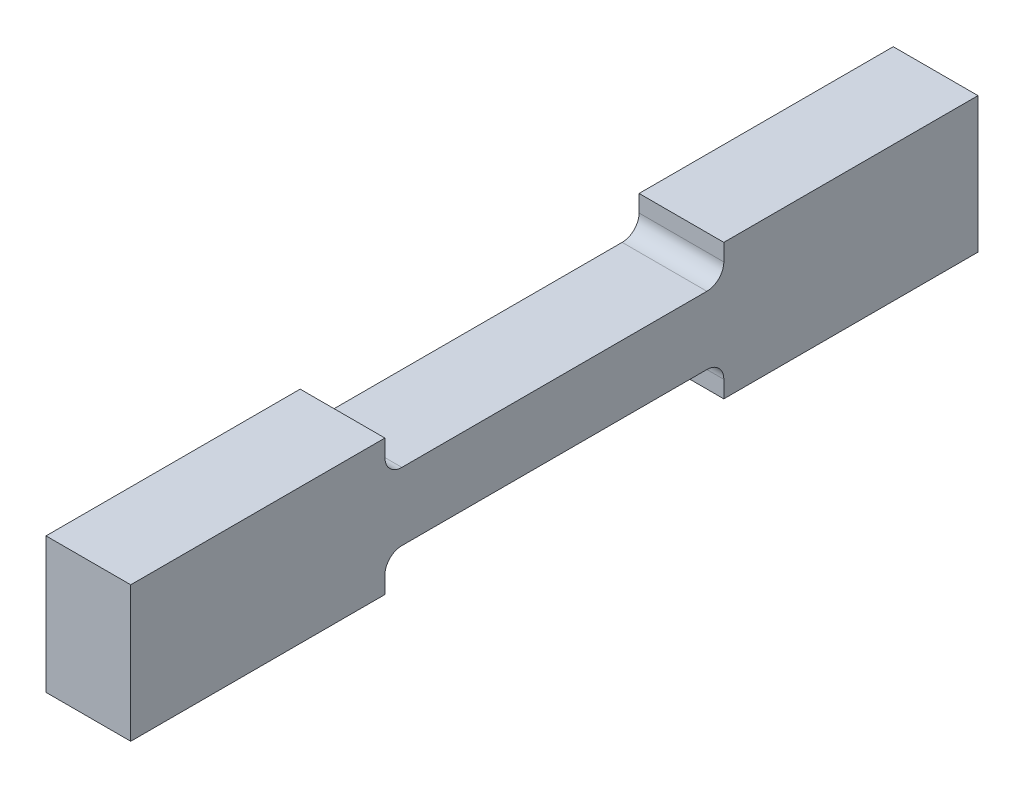
ISO-10303-21;
HEADER;
FILE_DESCRIPTION(('STEP AP214'),'2;1');
FILE_NAME('part.step','',(''),(''),'','','');
FILE_SCHEMA(('AUTOMOTIVE_DESIGN { 1 0 10303 214 1 1 1 1 }'));
ENDSEC;
DATA;
#1=APPLICATION_CONTEXT('core data for automotive mechanical design processes');
#2=APPLICATION_PROTOCOL_DEFINITION('international standard','automotive_design',2000,#1);
#3=PRODUCT_CONTEXT('',#1,'mechanical');
#4=PRODUCT('Part','Part','',(#3));
#5=PRODUCT_RELATED_PRODUCT_CATEGORY('part','',(#4));
#6=PRODUCT_DEFINITION_FORMATION('','',#4);
#7=PRODUCT_DEFINITION_CONTEXT('part definition',#1,'design');
#8=PRODUCT_DEFINITION('design','',#6,#7);
#9=PRODUCT_DEFINITION_SHAPE('','',#8);
#10=(LENGTH_UNIT() NAMED_UNIT(*) SI_UNIT(.MILLI.,.METRE.));
#11=(NAMED_UNIT(*) PLANE_ANGLE_UNIT() SI_UNIT($,.RADIAN.));
#12=(NAMED_UNIT(*) SI_UNIT($,.STERADIAN.) SOLID_ANGLE_UNIT());
#13=UNCERTAINTY_MEASURE_WITH_UNIT(LENGTH_MEASURE(1.E-05),#10,'distance_accuracy_value','');
#14=(GEOMETRIC_REPRESENTATION_CONTEXT(3) GLOBAL_UNCERTAINTY_ASSIGNED_CONTEXT((#13)) GLOBAL_UNIT_ASSIGNED_CONTEXT((#10,
#11,#12)) REPRESENTATION_CONTEXT('',''));
#15=CARTESIAN_POINT('',(0.,0.,0.));
#16=DIRECTION('',(0.,0.,1.));
#17=DIRECTION('',(1.,0.,0.));
#18=AXIS2_PLACEMENT_3D('',#15,#16,#17);
#19=CARTESIAN_POINT('',(2.5,-1.5,4.49999999999995));
#20=DIRECTION('',(-1.,0.,0.));
#21=DIRECTION('',(0.,0.,1.));
#22=AXIS2_PLACEMENT_3D('',#19,#20,#21);
#23=CYLINDRICAL_SURFACE('',#22,0.5);
#24=DIRECTION('',(-1.,0.,0.));
#25=VECTOR('',#24,1.);
#26=CARTESIAN_POINT('',(2.5,-1.,4.5));
#27=LINE('',#26,#25);
#28=CARTESIAN_POINT('',(2.5,-1.,4.5));
#29=VERTEX_POINT('',#28);
#30=CARTESIAN_POINT('',(0.,-1.,4.5));
#31=VERTEX_POINT('',#30);
#32=EDGE_CURVE('E276',#29,#31,#27,.T.);
#33=ORIENTED_EDGE('',*,*,#32,.F.);
#34=CARTESIAN_POINT('',(2.5,-1.5,4.49999999999995));
#35=DIRECTION('',(-1.,0.,0.));
#36=DIRECTION('',(0.,0.,1.));
#37=AXIS2_PLACEMENT_3D('',#34,#35,#36);
#38=CIRCLE('',#37,0.5);
#39=CARTESIAN_POINT('',(2.5,-1.49999999999995,5.));
#40=VERTEX_POINT('',#39);
#41=EDGE_CURVE('E53',#29,#40,#38,.F.);
#42=ORIENTED_EDGE('',*,*,#41,.T.);
#43=DIRECTION('',(-1.,0.,0.));
#44=VECTOR('',#43,1.);
#45=CARTESIAN_POINT('',(2.5,-1.49999999999995,5.));
#46=LINE('',#45,#44);
#47=CARTESIAN_POINT('',(0.,-1.49999999999995,5.));
#48=VERTEX_POINT('',#47);
#49=EDGE_CURVE('E279',#48,#40,#46,.F.);
#50=ORIENTED_EDGE('',*,*,#49,.F.);
#51=CARTESIAN_POINT('',(0.,-1.5,4.49999999999995));
#52=DIRECTION('',(-1.,0.,0.));
#53=DIRECTION('',(0.,0.,1.));
#54=AXIS2_PLACEMENT_3D('',#51,#52,#53);
#55=CIRCLE('',#54,0.5);
#56=EDGE_CURVE('E13',#48,#31,#55,.T.);
#57=ORIENTED_EDGE('',*,*,#56,.T.);
#58=EDGE_LOOP('',(#33,#42,#50,#57));
#59=FACE_BOUND('',#58,.T.);
#60=ADVANCED_FACE('F46',(#59),#23,.F.);
#61=CARTESIAN_POINT('',(2.5,1.5,4.49999999999995));
#62=DIRECTION('',(1.,0.,0.));
#63=DIRECTION('',(0.,0.,-1.));
#64=AXIS2_PLACEMENT_3D('',#61,#62,#63);
#65=CYLINDRICAL_SURFACE('',#64,0.5);
#66=DIRECTION('',(1.,0.,0.));
#67=VECTOR('',#66,1.);
#68=CARTESIAN_POINT('',(2.5,1.,4.5));
#69=LINE('',#68,#67);
#70=CARTESIAN_POINT('',(0.,1.,4.5));
#71=VERTEX_POINT('',#70);
#72=CARTESIAN_POINT('',(2.5,1.,4.5));
#73=VERTEX_POINT('',#72);
#74=EDGE_CURVE('E266',#71,#73,#69,.T.);
#75=ORIENTED_EDGE('',*,*,#74,.F.);
#76=CARTESIAN_POINT('',(0.,1.5,4.49999999999995));
#77=DIRECTION('',(-1.,0.,0.));
#78=DIRECTION('',(0.,0.,1.));
#79=AXIS2_PLACEMENT_3D('',#76,#77,#78);
#80=CIRCLE('',#79,0.5);
#81=CARTESIAN_POINT('',(0.,1.50000000000006,4.99999999999989));
#82=VERTEX_POINT('',#81);
#83=EDGE_CURVE('E272',#71,#82,#80,.T.);
#84=ORIENTED_EDGE('',*,*,#83,.T.);
#85=DIRECTION('',(1.,0.,0.));
#86=VECTOR('',#85,1.);
#87=CARTESIAN_POINT('',(2.5,1.50000000000006,4.99999999999989));
#88=LINE('',#87,#86);
#89=CARTESIAN_POINT('',(2.5,1.50000000000006,4.99999999999989));
#90=VERTEX_POINT('',#89);
#91=EDGE_CURVE('E269',#90,#82,#88,.F.);
#92=ORIENTED_EDGE('',*,*,#91,.F.);
#93=CARTESIAN_POINT('',(2.5,1.5,4.49999999999995));
#94=DIRECTION('',(-1.,0.,0.));
#95=DIRECTION('',(0.,0.,1.));
#96=AXIS2_PLACEMENT_3D('',#93,#94,#95);
#97=CIRCLE('',#96,0.5);
#98=EDGE_CURVE('E274',#90,#73,#97,.F.);
#99=ORIENTED_EDGE('',*,*,#98,.T.);
#100=EDGE_LOOP('',(#75,#84,#92,#99));
#101=FACE_BOUND('',#100,.T.);
#102=ADVANCED_FACE('F327',(#101),#65,.F.);
#103=CARTESIAN_POINT('',(2.5,-1.5,-4.50000000000012));
#104=DIRECTION('',(1.,0.,0.));
#105=DIRECTION('',(0.,0.,-1.));
#106=AXIS2_PLACEMENT_3D('',#103,#104,#105);
#107=CYLINDRICAL_SURFACE('',#106,0.5);
#108=DIRECTION('',(-1.,0.,0.));
#109=VECTOR('',#108,1.);
#110=CARTESIAN_POINT('',(2.5,-1.50000000000006,-5.));
#111=LINE('',#110,#109);
#112=CARTESIAN_POINT('',(2.5,-1.50000000000006,-5.));
#113=VERTEX_POINT('',#112);
#114=CARTESIAN_POINT('',(0.,-1.50000000000006,-5.));
#115=VERTEX_POINT('',#114);
#116=EDGE_CURVE('E255',#113,#115,#111,.T.);
#117=ORIENTED_EDGE('',*,*,#116,.F.);
#118=CARTESIAN_POINT('',(2.5,-1.5,-4.50000000000012));
#119=DIRECTION('',(-1.,0.,0.));
#120=DIRECTION('',(0.,0.,1.));
#121=AXIS2_PLACEMENT_3D('',#118,#119,#120);
#122=CIRCLE('',#121,0.5);
#123=CARTESIAN_POINT('',(2.5,-1.,-4.5));
#124=VERTEX_POINT('',#123);
#125=EDGE_CURVE('E261',#113,#124,#122,.F.);
#126=ORIENTED_EDGE('',*,*,#125,.T.);
#127=DIRECTION('',(-1.,0.,0.));
#128=VECTOR('',#127,1.);
#129=CARTESIAN_POINT('',(2.5,-1.,-4.5));
#130=LINE('',#129,#128);
#131=CARTESIAN_POINT('',(0.,-1.,-4.5));
#132=VERTEX_POINT('',#131);
#133=EDGE_CURVE('E258',#132,#124,#130,.F.);
#134=ORIENTED_EDGE('',*,*,#133,.F.);
#135=CARTESIAN_POINT('',(0.,-1.5,-4.50000000000012));
#136=DIRECTION('',(-1.,0.,0.));
#137=DIRECTION('',(0.,0.,1.));
#138=AXIS2_PLACEMENT_3D('',#135,#136,#137);
#139=CIRCLE('',#138,0.5);
#140=EDGE_CURVE('E264',#132,#115,#139,.T.);
#141=ORIENTED_EDGE('',*,*,#140,.T.);
#142=EDGE_LOOP('',(#117,#126,#134,#141));
#143=FACE_BOUND('',#142,.T.);
#144=ADVANCED_FACE('F290',(#143),#107,.F.);
#145=CARTESIAN_POINT('',(2.5,1.5,-4.5));
#146=DIRECTION('',(-1.,0.,0.));
#147=DIRECTION('',(0.,0.,1.));
#148=AXIS2_PLACEMENT_3D('',#145,#146,#147);
#149=CYLINDRICAL_SURFACE('',#148,0.5);
#150=DIRECTION('',(1.,0.,0.));
#151=VECTOR('',#150,1.);
#152=CARTESIAN_POINT('',(2.5,1.5,-5.));
#153=LINE('',#152,#151);
#154=CARTESIAN_POINT('',(0.,1.5,-5.));
#155=VERTEX_POINT('',#154);
#156=CARTESIAN_POINT('',(2.5,1.5,-5.));
#157=VERTEX_POINT('',#156);
#158=EDGE_CURVE('E229',#155,#157,#153,.T.);
#159=ORIENTED_EDGE('',*,*,#158,.F.);
#160=CARTESIAN_POINT('',(0.,1.5,-4.5));
#161=DIRECTION('',(-1.,0.,0.));
#162=DIRECTION('',(0.,0.,1.));
#163=AXIS2_PLACEMENT_3D('',#160,#161,#162);
#164=CIRCLE('',#163,0.5);
#165=CARTESIAN_POINT('',(0.,1.,-4.5));
#166=VERTEX_POINT('',#165);
#167=EDGE_CURVE('E250',#155,#166,#164,.T.);
#168=ORIENTED_EDGE('',*,*,#167,.T.);
#169=DIRECTION('',(1.,0.,0.));
#170=VECTOR('',#169,1.);
#171=CARTESIAN_POINT('',(2.5,1.,-4.5));
#172=LINE('',#171,#170);
#173=CARTESIAN_POINT('',(2.5,1.,-4.5));
#174=VERTEX_POINT('',#173);
#175=EDGE_CURVE('E247',#174,#166,#172,.F.);
#176=ORIENTED_EDGE('',*,*,#175,.F.);
#177=CARTESIAN_POINT('',(2.5,1.5,-4.5));
#178=DIRECTION('',(-1.,0.,0.));
#179=DIRECTION('',(0.,0.,1.));
#180=AXIS2_PLACEMENT_3D('',#177,#178,#179);
#181=CIRCLE('',#180,0.5);
#182=EDGE_CURVE('E253',#174,#157,#181,.F.);
#183=ORIENTED_EDGE('',*,*,#182,.T.);
#184=EDGE_LOOP('',(#159,#168,#176,#183));
#185=FACE_BOUND('',#184,.T.);
#186=ADVANCED_FACE('F318',(#185),#149,.F.);
#187=CARTESIAN_POINT('',(2.5,-2.,5.00000000000006));
#188=DIRECTION('',(0.,-1.,0.));
#189=DIRECTION('',(0.,0.,-1.));
#190=AXIS2_PLACEMENT_3D('',#187,#188,#189);
#191=PLANE('',#190);
#192=DIRECTION('',(0.,0.,1.));
#193=VECTOR('',#192,1.);
#194=CARTESIAN_POINT('',(0.,-2.,5.00000000000006));
#195=LINE('',#194,#193);
#196=CARTESIAN_POINT('',(0.,-2.,5.00000000000006));
#197=VERTEX_POINT('',#196);
#198=CARTESIAN_POINT('',(0.,-2.,12.5));
#199=VERTEX_POINT('',#198);
#200=EDGE_CURVE('E205',#197,#199,#195,.T.);
#201=ORIENTED_EDGE('',*,*,#200,.F.);
#202=DIRECTION('',(-1.,0.,0.));
#203=VECTOR('',#202,1.);
#204=CARTESIAN_POINT('',(2.5,-2.,5.00000000000006));
#205=LINE('',#204,#203);
#206=CARTESIAN_POINT('',(2.5,-2.,5.00000000000006));
#207=VERTEX_POINT('',#206);
#208=EDGE_CURVE('E180',#207,#197,#205,.T.);
#209=ORIENTED_EDGE('',*,*,#208,.F.);
#210=DIRECTION('',(0.,0.,1.));
#211=VECTOR('',#210,1.);
#212=CARTESIAN_POINT('',(2.5,-2.,5.00000000000006));
#213=LINE('',#212,#211);
#214=CARTESIAN_POINT('',(2.5,-2.,12.5));
#215=VERTEX_POINT('',#214);
#216=EDGE_CURVE('E172',#207,#215,#213,.T.);
#217=ORIENTED_EDGE('',*,*,#216,.T.);
#218=DIRECTION('',(-1.,0.,0.));
#219=VECTOR('',#218,1.);
#220=CARTESIAN_POINT('',(2.5,-2.,12.5));
#221=LINE('',#220,#219);
#222=EDGE_CURVE('E155',#215,#199,#221,.T.);
#223=ORIENTED_EDGE('',*,*,#222,.T.);
#224=EDGE_LOOP('',(#201,#209,#217,#223));
#225=FACE_BOUND('',#224,.T.);
#226=ADVANCED_FACE('F178',(#225),#191,.T.);
#227=CARTESIAN_POINT('',(2.5,-1.,4.99999999999989));
#228=DIRECTION('',(0.,0.,-1.));
#229=DIRECTION('',(-1.,0.,0.));
#230=AXIS2_PLACEMENT_3D('',#227,#228,#229);
#231=PLANE('',#230);
#232=DIRECTION('',(0.,-1.,0.));
#233=VECTOR('',#232,1.);
#234=CARTESIAN_POINT('',(0.,-1.,4.99999999999989));
#235=LINE('',#234,#233);
#236=EDGE_CURVE('E181',#48,#197,#235,.T.);
#237=ORIENTED_EDGE('',*,*,#236,.F.);
#238=ORIENTED_EDGE('',*,*,#49,.T.);
#239=DIRECTION('',(0.,-1.,0.));
#240=VECTOR('',#239,1.);
#241=CARTESIAN_POINT('',(2.5,-1.,4.99999999999989));
#242=LINE('',#241,#240);
#243=EDGE_CURVE('E166',#40,#207,#242,.T.);
#244=ORIENTED_EDGE('',*,*,#243,.T.);
#245=ORIENTED_EDGE('',*,*,#208,.T.);
#246=EDGE_LOOP('',(#237,#238,#244,#245));
#247=FACE_BOUND('',#246,.T.);
#248=ADVANCED_FACE('F282',(#247),#231,.T.);
#249=CARTESIAN_POINT('',(2.5,-1.,4.99999999999989));
#250=DIRECTION('',(0.,1.,0.));
#251=DIRECTION('',(0.,0.,1.));
#252=AXIS2_PLACEMENT_3D('',#249,#250,#251);
#253=PLANE('',#252);
#254=DIRECTION('',(0.,0.,-1.));
#255=VECTOR('',#254,1.);
#256=CARTESIAN_POINT('',(2.5,-1.,4.99999999999989));
#257=LINE('',#256,#255);
#258=EDGE_CURVE('E202',#29,#124,#257,.T.);
#259=ORIENTED_EDGE('',*,*,#258,.F.);
#260=ORIENTED_EDGE('',*,*,#32,.T.);
#261=DIRECTION('',(0.,0.,-1.));
#262=VECTOR('',#261,1.);
#263=CARTESIAN_POINT('',(0.,-1.,4.99999999999989));
#264=LINE('',#263,#262);
#265=EDGE_CURVE('E183',#31,#132,#264,.T.);
#266=ORIENTED_EDGE('',*,*,#265,.T.);
#267=ORIENTED_EDGE('',*,*,#133,.T.);
#268=EDGE_LOOP('',(#259,#260,#266,#267));
#269=FACE_BOUND('',#268,.T.);
#270=ADVANCED_FACE('F285',(#269),#253,.F.);
#271=CARTESIAN_POINT('',(2.5,-1.,-4.99999999999989));
#272=DIRECTION('',(0.,0.,-1.));
#273=DIRECTION('',(-1.,0.,0.));
#274=AXIS2_PLACEMENT_3D('',#271,#272,#273);
#275=PLANE('',#274);
#276=DIRECTION('',(0.,-1.,0.));
#277=VECTOR('',#276,1.);
#278=CARTESIAN_POINT('',(2.5,-1.,-4.99999999999989));
#279=LINE('',#278,#277);
#280=CARTESIAN_POINT('',(2.5,-2.,-5.));
#281=VERTEX_POINT('',#280);
#282=EDGE_CURVE('E200',#113,#281,#279,.T.);
#283=ORIENTED_EDGE('',*,*,#282,.F.);
#284=ORIENTED_EDGE('',*,*,#116,.T.);
#285=DIRECTION('',(0.,-1.,0.));
#286=VECTOR('',#285,1.);
#287=CARTESIAN_POINT('',(0.,-1.,-4.99999999999989));
#288=LINE('',#287,#286);
#289=CARTESIAN_POINT('',(0.,-2.,-5.));
#290=VERTEX_POINT('',#289);
#291=EDGE_CURVE('E225',#115,#290,#288,.T.);
#292=ORIENTED_EDGE('',*,*,#291,.T.);
#293=DIRECTION('',(-1.,0.,0.));
#294=VECTOR('',#293,1.);
#295=CARTESIAN_POINT('',(2.5,-2.,-5.));
#296=LINE('',#295,#294);
#297=EDGE_CURVE('E230',#281,#290,#296,.T.);
#298=ORIENTED_EDGE('',*,*,#297,.F.);
#299=EDGE_LOOP('',(#283,#284,#292,#298));
#300=FACE_BOUND('',#299,.T.);
#301=ADVANCED_FACE('F296',(#300),#275,.F.);
#302=CARTESIAN_POINT('',(2.5,-2.,-5.));
#303=DIRECTION('',(0.,1.,0.));
#304=DIRECTION('',(0.,0.,1.));
#305=AXIS2_PLACEMENT_3D('',#302,#303,#304);
#306=PLANE('',#305);
#307=DIRECTION('',(0.,0.,-1.));
#308=VECTOR('',#307,1.);
#309=CARTESIAN_POINT('',(0.,-2.,-5.));
#310=LINE('',#309,#308);
#311=CARTESIAN_POINT('',(0.,-2.,-12.5000000000001));
#312=VERTEX_POINT('',#311);
#313=EDGE_CURVE('E223',#290,#312,#310,.T.);
#314=ORIENTED_EDGE('',*,*,#313,.T.);
#315=DIRECTION('',(-1.,0.,0.));
#316=VECTOR('',#315,1.);
#317=CARTESIAN_POINT('',(2.5,-2.,-12.5000000000001));
#318=LINE('',#317,#316);
#319=CARTESIAN_POINT('',(2.5,-2.,-12.5000000000001));
#320=VERTEX_POINT('',#319);
#321=EDGE_CURVE('E233',#320,#312,#318,.T.);
#322=ORIENTED_EDGE('',*,*,#321,.F.);
#323=DIRECTION('',(0.,0.,-1.));
#324=VECTOR('',#323,1.);
#325=CARTESIAN_POINT('',(2.5,-2.,-5.));
#326=LINE('',#325,#324);
#327=EDGE_CURVE('E198',#281,#320,#326,.T.);
#328=ORIENTED_EDGE('',*,*,#327,.F.);
#329=ORIENTED_EDGE('',*,*,#297,.T.);
#330=EDGE_LOOP('',(#314,#322,#328,#329));
#331=FACE_BOUND('',#330,.T.);
#332=ADVANCED_FACE('F300',(#331),#306,.F.);
#333=CARTESIAN_POINT('',(2.5,-2.,-12.5000000000001));
#334=DIRECTION('',(0.,0.,1.));
#335=DIRECTION('',(1.,0.,0.));
#336=AXIS2_PLACEMENT_3D('',#333,#334,#335);
#337=PLANE('',#336);
#338=DIRECTION('',(0.,1.,0.));
#339=VECTOR('',#338,1.);
#340=CARTESIAN_POINT('',(0.,-2.,-12.5000000000001));
#341=LINE('',#340,#339);
#342=CARTESIAN_POINT('',(0.,2.,-12.4999999999998));
#343=VERTEX_POINT('',#342);
#344=EDGE_CURVE('E220',#312,#343,#341,.T.);
#345=ORIENTED_EDGE('',*,*,#344,.T.);
#346=DIRECTION('',(-1.,0.,0.));
#347=VECTOR('',#346,1.);
#348=CARTESIAN_POINT('',(2.5,2.,-12.4999999999998));
#349=LINE('',#348,#347);
#350=CARTESIAN_POINT('',(2.5,2.,-12.4999999999998));
#351=VERTEX_POINT('',#350);
#352=EDGE_CURVE('E236',#351,#343,#349,.T.);
#353=ORIENTED_EDGE('',*,*,#352,.F.);
#354=DIRECTION('',(0.,1.,0.));
#355=VECTOR('',#354,1.);
#356=CARTESIAN_POINT('',(2.5,-2.,-12.5000000000001));
#357=LINE('',#356,#355);
#358=EDGE_CURVE('E196',#320,#351,#357,.T.);
#359=ORIENTED_EDGE('',*,*,#358,.F.);
#360=ORIENTED_EDGE('',*,*,#321,.T.);
#361=EDGE_LOOP('',(#345,#353,#359,#360));
#362=FACE_BOUND('',#361,.T.);
#363=ADVANCED_FACE('F305',(#362),#337,.F.);
#364=CARTESIAN_POINT('',(2.5,2.,-5.));
#365=DIRECTION('',(0.,1.,0.));
#366=DIRECTION('',(0.,0.,1.));
#367=AXIS2_PLACEMENT_3D('',#364,#365,#366);
#368=PLANE('',#367);
#369=DIRECTION('',(0.,0.,-1.));
#370=VECTOR('',#369,1.);
#371=CARTESIAN_POINT('',(0.,2.,-5.));
#372=LINE('',#371,#370);
#373=CARTESIAN_POINT('',(0.,2.,-5.));
#374=VERTEX_POINT('',#373);
#375=EDGE_CURVE('E217',#374,#343,#372,.T.);
#376=ORIENTED_EDGE('',*,*,#375,.F.);
#377=DIRECTION('',(-1.,0.,0.));
#378=VECTOR('',#377,1.);
#379=CARTESIAN_POINT('',(2.5,2.,-5.));
#380=LINE('',#379,#378);
#381=CARTESIAN_POINT('',(2.5,2.,-5.));
#382=VERTEX_POINT('',#381);
#383=EDGE_CURVE('E238',#382,#374,#380,.T.);
#384=ORIENTED_EDGE('',*,*,#383,.F.);
#385=DIRECTION('',(0.,0.,-1.));
#386=VECTOR('',#385,1.);
#387=CARTESIAN_POINT('',(2.5,2.,-5.));
#388=LINE('',#387,#386);
#389=EDGE_CURVE('E193',#382,#351,#388,.T.);
#390=ORIENTED_EDGE('',*,*,#389,.T.);
#391=ORIENTED_EDGE('',*,*,#352,.T.);
#392=EDGE_LOOP('',(#376,#384,#390,#391));
#393=FACE_BOUND('',#392,.T.);
#394=ADVANCED_FACE('F312',(#393),#368,.T.);
#395=CARTESIAN_POINT('',(2.5,0.999999999999945,-5.00000000000012));
#396=DIRECTION('',(0.,0.,1.));
#397=DIRECTION('',(1.,0.,0.));
#398=AXIS2_PLACEMENT_3D('',#395,#396,#397);
#399=PLANE('',#398);
#400=DIRECTION('',(0.,1.,0.));
#401=VECTOR('',#400,1.);
#402=CARTESIAN_POINT('',(0.,0.999999999999945,-5.00000000000012));
#403=LINE('',#402,#401);
#404=EDGE_CURVE('E215',#155,#374,#403,.T.);
#405=ORIENTED_EDGE('',*,*,#404,.F.);
#406=ORIENTED_EDGE('',*,*,#158,.T.);
#407=DIRECTION('',(0.,1.,0.));
#408=VECTOR('',#407,1.);
#409=CARTESIAN_POINT('',(2.5,0.999999999999945,-5.00000000000012));
#410=LINE('',#409,#408);
#411=EDGE_CURVE('E191',#157,#382,#410,.T.);
#412=ORIENTED_EDGE('',*,*,#411,.T.);
#413=ORIENTED_EDGE('',*,*,#383,.T.);
#414=EDGE_LOOP('',(#405,#406,#412,#413));
#415=FACE_BOUND('',#414,.T.);
#416=ADVANCED_FACE('F315',(#415),#399,.T.);
#417=CARTESIAN_POINT('',(2.5,1.,4.99999999999995));
#418=DIRECTION('',(0.,1.,0.));
#419=DIRECTION('',(0.,0.,1.));
#420=AXIS2_PLACEMENT_3D('',#417,#418,#419);
#421=PLANE('',#420);
#422=DIRECTION('',(0.,0.,-1.));
#423=VECTOR('',#422,1.);
#424=CARTESIAN_POINT('',(0.,1.,4.99999999999995));
#425=LINE('',#424,#423);
#426=EDGE_CURVE('E213',#71,#166,#425,.T.);
#427=ORIENTED_EDGE('',*,*,#426,.F.);
#428=ORIENTED_EDGE('',*,*,#74,.T.);
#429=DIRECTION('',(0.,0.,-1.));
#430=VECTOR('',#429,1.);
#431=CARTESIAN_POINT('',(2.5,1.,4.99999999999995));
#432=LINE('',#431,#430);
#433=EDGE_CURVE('E189',#73,#174,#432,.T.);
#434=ORIENTED_EDGE('',*,*,#433,.T.);
#435=ORIENTED_EDGE('',*,*,#175,.T.);
#436=EDGE_LOOP('',(#427,#428,#434,#435));
#437=FACE_BOUND('',#436,.T.);
#438=ADVANCED_FACE('F324',(#437),#421,.T.);
#439=CARTESIAN_POINT('',(2.5,1.,4.99999999999995));
#440=DIRECTION('',(0.,0.,1.));
#441=DIRECTION('',(1.,0.,0.));
#442=AXIS2_PLACEMENT_3D('',#439,#440,#441);
#443=PLANE('',#442);
#444=DIRECTION('',(0.,1.,0.));
#445=VECTOR('',#444,1.);
#446=CARTESIAN_POINT('',(2.5,1.,4.99999999999995));
#447=LINE('',#446,#445);
#448=CARTESIAN_POINT('',(2.5,2.,5.));
#449=VERTEX_POINT('',#448);
#450=EDGE_CURVE('E187',#90,#449,#447,.T.);
#451=ORIENTED_EDGE('',*,*,#450,.F.);
#452=ORIENTED_EDGE('',*,*,#91,.T.);
#453=DIRECTION('',(0.,1.,0.));
#454=VECTOR('',#453,1.);
#455=CARTESIAN_POINT('',(0.,1.,4.99999999999995));
#456=LINE('',#455,#454);
#457=CARTESIAN_POINT('',(0.,2.,5.));
#458=VERTEX_POINT('',#457);
#459=EDGE_CURVE('E211',#82,#458,#456,.T.);
#460=ORIENTED_EDGE('',*,*,#459,.T.);
#461=DIRECTION('',(-1.,0.,0.));
#462=VECTOR('',#461,1.);
#463=CARTESIAN_POINT('',(2.5,2.,5.));
#464=LINE('',#463,#462);
#465=EDGE_CURVE('E241',#449,#458,#464,.T.);
#466=ORIENTED_EDGE('',*,*,#465,.F.);
#467=EDGE_LOOP('',(#451,#452,#460,#466));
#468=FACE_BOUND('',#467,.T.);
#469=ADVANCED_FACE('F332',(#468),#443,.F.);
#470=CARTESIAN_POINT('',(2.5,2.,5.));
#471=DIRECTION('',(0.,-1.,0.));
#472=DIRECTION('',(0.,0.,-1.));
#473=AXIS2_PLACEMENT_3D('',#470,#471,#472);
#474=PLANE('',#473);
#475=DIRECTION('',(0.,0.,1.));
#476=VECTOR('',#475,1.);
#477=CARTESIAN_POINT('',(0.,2.,5.));
#478=LINE('',#477,#476);
#479=CARTESIAN_POINT('',(0.,2.,12.5));
#480=VERTEX_POINT('',#479);
#481=EDGE_CURVE('E208',#458,#480,#478,.T.);
#482=ORIENTED_EDGE('',*,*,#481,.T.);
#483=DIRECTION('',(-1.,0.,0.));
#484=VECTOR('',#483,1.);
#485=CARTESIAN_POINT('',(2.5,2.,12.5));
#486=LINE('',#485,#484);
#487=CARTESIAN_POINT('',(2.5,2.,12.5));
#488=VERTEX_POINT('',#487);
#489=EDGE_CURVE('E165',#488,#480,#486,.T.);
#490=ORIENTED_EDGE('',*,*,#489,.F.);
#491=DIRECTION('',(0.,0.,1.));
#492=VECTOR('',#491,1.);
#493=CARTESIAN_POINT('',(2.5,2.,5.));
#494=LINE('',#493,#492);
#495=EDGE_CURVE('E174',#449,#488,#494,.T.);
#496=ORIENTED_EDGE('',*,*,#495,.F.);
#497=ORIENTED_EDGE('',*,*,#465,.T.);
#498=EDGE_LOOP('',(#482,#490,#496,#497));
#499=FACE_BOUND('',#498,.T.);
#500=ADVANCED_FACE('F335',(#499),#474,.F.);
#501=CARTESIAN_POINT('',(2.5,-2.,12.5));
#502=DIRECTION('',(0.,0.,1.));
#503=DIRECTION('',(1.,0.,0.));
#504=AXIS2_PLACEMENT_3D('',#501,#502,#503);
#505=PLANE('',#504);
#506=DIRECTION('',(0.,1.,0.));
#507=VECTOR('',#506,1.);
#508=CARTESIAN_POINT('',(0.,-2.,12.5));
#509=LINE('',#508,#507);
#510=EDGE_CURVE('E160',#199,#480,#509,.T.);
#511=ORIENTED_EDGE('',*,*,#510,.F.);
#512=ORIENTED_EDGE('',*,*,#222,.F.);
#513=DIRECTION('',(0.,1.,0.));
#514=VECTOR('',#513,1.);
#515=CARTESIAN_POINT('',(2.5,-2.,12.5));
#516=LINE('',#515,#514);
#517=EDGE_CURVE('E158',#215,#488,#516,.T.);
#518=ORIENTED_EDGE('',*,*,#517,.T.);
#519=ORIENTED_EDGE('',*,*,#489,.T.);
#520=EDGE_LOOP('',(#511,#512,#518,#519));
#521=FACE_BOUND('',#520,.T.);
#522=ADVANCED_FACE('F157',(#521),#505,.T.);
#523=CARTESIAN_POINT('',(2.5,0.,0.));
#524=DIRECTION('',(-1.,0.,0.));
#525=DIRECTION('',(0.,0.,1.));
#526=AXIS2_PLACEMENT_3D('',#523,#524,#525);
#527=PLANE('',#526);
#528=ORIENTED_EDGE('',*,*,#41,.F.);
#529=ORIENTED_EDGE('',*,*,#258,.T.);
#530=ORIENTED_EDGE('',*,*,#125,.F.);
#531=ORIENTED_EDGE('',*,*,#282,.T.);
#532=ORIENTED_EDGE('',*,*,#327,.T.);
#533=ORIENTED_EDGE('',*,*,#358,.T.);
#534=ORIENTED_EDGE('',*,*,#389,.F.);
#535=ORIENTED_EDGE('',*,*,#411,.F.);
#536=ORIENTED_EDGE('',*,*,#182,.F.);
#537=ORIENTED_EDGE('',*,*,#433,.F.);
#538=ORIENTED_EDGE('',*,*,#98,.F.);
#539=ORIENTED_EDGE('',*,*,#450,.T.);
#540=ORIENTED_EDGE('',*,*,#495,.T.);
#541=ORIENTED_EDGE('',*,*,#517,.F.);
#542=ORIENTED_EDGE('',*,*,#216,.F.);
#543=ORIENTED_EDGE('',*,*,#243,.F.);
#544=EDGE_LOOP('',(#528,#529,#530,#531,#532,#533,#534,#535,#536,#537,#538,#539,#540,#541,#542,#543));
#545=FACE_BOUND('',#544,.T.);
#546=ADVANCED_FACE('F170',(#545),#527,.F.);
#547=CARTESIAN_POINT('',(0.,0.,0.));
#548=DIRECTION('',(-1.,0.,0.));
#549=DIRECTION('',(0.,0.,1.));
#550=AXIS2_PLACEMENT_3D('',#547,#548,#549);
#551=PLANE('',#550);
#552=ORIENTED_EDGE('',*,*,#56,.F.);
#553=ORIENTED_EDGE('',*,*,#236,.T.);
#554=ORIENTED_EDGE('',*,*,#200,.T.);
#555=ORIENTED_EDGE('',*,*,#510,.T.);
#556=ORIENTED_EDGE('',*,*,#481,.F.);
#557=ORIENTED_EDGE('',*,*,#459,.F.);
#558=ORIENTED_EDGE('',*,*,#83,.F.);
#559=ORIENTED_EDGE('',*,*,#426,.T.);
#560=ORIENTED_EDGE('',*,*,#167,.F.);
#561=ORIENTED_EDGE('',*,*,#404,.T.);
#562=ORIENTED_EDGE('',*,*,#375,.T.);
#563=ORIENTED_EDGE('',*,*,#344,.F.);
#564=ORIENTED_EDGE('',*,*,#313,.F.);
#565=ORIENTED_EDGE('',*,*,#291,.F.);
#566=ORIENTED_EDGE('',*,*,#140,.F.);
#567=ORIENTED_EDGE('',*,*,#265,.F.);
#568=EDGE_LOOP('',(#552,#553,#554,#555,#556,#557,#558,#559,#560,#561,#562,#563,#564,#565,#566,#567));
#569=FACE_BOUND('',#568,.T.);
#570=ADVANCED_FACE('F336',(#569),#551,.T.);
#571=CLOSED_SHELL('',(#60,#102,#144,#186,#226,#248,#270,#301,#332,#363,#394,#416,#438,#469,#500,
#522,#546,#570));
#572=MANIFOLD_SOLID_BREP('B2',#571);
#573=ADVANCED_BREP_SHAPE_REPRESENTATION('',(#18,#572),#14);
#574=SHAPE_DEFINITION_REPRESENTATION(#9,#573);
ENDSEC;
END-ISO-10303-21;
